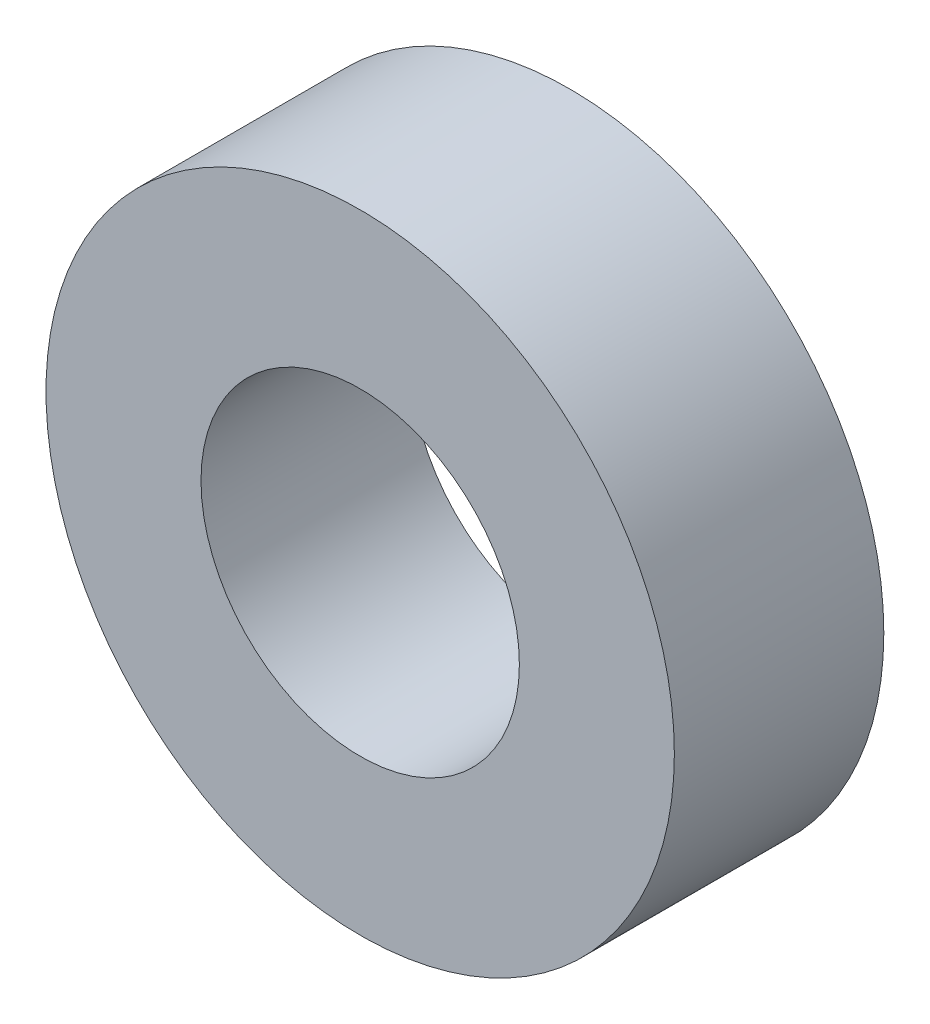
ISO-10303-21;
HEADER;
FILE_DESCRIPTION(('STEP AP214'),'2;1');
FILE_NAME('part.step','',(''),(''),'','','');
FILE_SCHEMA(('AUTOMOTIVE_DESIGN { 1 0 10303 214 1 1 1 1 }'));
ENDSEC;
DATA;
#1=APPLICATION_CONTEXT('core data for automotive mechanical design processes');
#2=APPLICATION_PROTOCOL_DEFINITION('international standard','automotive_design',2000,#1);
#3=PRODUCT_CONTEXT('',#1,'mechanical');
#4=PRODUCT('Part','Part','',(#3));
#5=PRODUCT_RELATED_PRODUCT_CATEGORY('part','',(#4));
#6=PRODUCT_DEFINITION_FORMATION('','',#4);
#7=PRODUCT_DEFINITION_CONTEXT('part definition',#1,'design');
#8=PRODUCT_DEFINITION('design','',#6,#7);
#9=PRODUCT_DEFINITION_SHAPE('','',#8);
#10=(LENGTH_UNIT() NAMED_UNIT(*) SI_UNIT(.MILLI.,.METRE.));
#11=(NAMED_UNIT(*) PLANE_ANGLE_UNIT() SI_UNIT($,.RADIAN.));
#12=(NAMED_UNIT(*) SI_UNIT($,.STERADIAN.) SOLID_ANGLE_UNIT());
#13=UNCERTAINTY_MEASURE_WITH_UNIT(LENGTH_MEASURE(1.E-05),#10,'distance_accuracy_value','');
#14=(GEOMETRIC_REPRESENTATION_CONTEXT(3) GLOBAL_UNCERTAINTY_ASSIGNED_CONTEXT((#13)) GLOBAL_UNIT_ASSIGNED_CONTEXT((#10,
#11,#12)) REPRESENTATION_CONTEXT('',''));
#15=CARTESIAN_POINT('',(0.,0.,0.));
#16=DIRECTION('',(0.,0.,1.));
#17=DIRECTION('',(1.,0.,0.));
#18=AXIS2_PLACEMENT_3D('',#15,#16,#17);
#19=CARTESIAN_POINT('',(0.,0.,3.175));
#20=DIRECTION('',(0.,0.,1.));
#21=DIRECTION('',(1.,0.,0.));
#22=AXIS2_PLACEMENT_3D('',#19,#20,#21);
#23=PLANE('',#22);
#24=CARTESIAN_POINT('',(0.,0.,3.175));
#25=DIRECTION('',(0.,0.,1.));
#26=DIRECTION('',(1.,0.,0.));
#27=AXIS2_PLACEMENT_3D('',#24,#25,#26);
#28=CIRCLE('',#27,9.525);
#29=CARTESIAN_POINT('',(9.525,0.,3.175));
#30=VERTEX_POINT('',#29);
#31=EDGE_CURVE('E10',#30,#30,#28,.T.);
#32=ORIENTED_EDGE('',*,*,#31,.T.);
#33=EDGE_LOOP('',(#32));
#34=FACE_BOUND('',#33,.T.);
#35=CARTESIAN_POINT('',(0.,0.,3.175));
#36=DIRECTION('',(0.,0.,1.));
#37=DIRECTION('',(1.,0.,0.));
#38=AXIS2_PLACEMENT_3D('',#35,#36,#37);
#39=CIRCLE('',#38,4.826);
#40=CARTESIAN_POINT('',(4.826,0.,3.175));
#41=VERTEX_POINT('',#40);
#42=EDGE_CURVE('E43',#41,#41,#39,.T.);
#43=ORIENTED_EDGE('',*,*,#42,.F.);
#44=EDGE_LOOP('',(#43));
#45=FACE_BOUND('',#44,.T.);
#46=ADVANCED_FACE('F32',(#34,#45),#23,.T.);
#47=CARTESIAN_POINT('',(0.,0.,-3.175));
#48=DIRECTION('',(0.,0.,1.));
#49=DIRECTION('',(1.,0.,0.));
#50=AXIS2_PLACEMENT_3D('',#47,#48,#49);
#51=PLANE('',#50);
#52=CARTESIAN_POINT('',(0.,0.,-3.175));
#53=DIRECTION('',(0.,0.,1.));
#54=DIRECTION('',(1.,0.,0.));
#55=AXIS2_PLACEMENT_3D('',#52,#53,#54);
#56=CIRCLE('',#55,9.525);
#57=CARTESIAN_POINT('',(9.525,0.,-3.175));
#58=VERTEX_POINT('',#57);
#59=EDGE_CURVE('E36',#58,#58,#56,.T.);
#60=ORIENTED_EDGE('',*,*,#59,.F.);
#61=EDGE_LOOP('',(#60));
#62=FACE_BOUND('',#61,.T.);
#63=CARTESIAN_POINT('',(0.,0.,-3.175));
#64=DIRECTION('',(0.,0.,1.));
#65=DIRECTION('',(1.,0.,0.));
#66=AXIS2_PLACEMENT_3D('',#63,#64,#65);
#67=CIRCLE('',#66,4.826);
#68=CARTESIAN_POINT('',(4.826,0.,-3.175));
#69=VERTEX_POINT('',#68);
#70=EDGE_CURVE('E45',#69,#69,#67,.T.);
#71=ORIENTED_EDGE('',*,*,#70,.T.);
#72=EDGE_LOOP('',(#71));
#73=FACE_BOUND('',#72,.T.);
#74=ADVANCED_FACE('F55',(#62,#73),#51,.F.);
#75=CARTESIAN_POINT('',(0.,0.,3.175));
#76=DIRECTION('',(0.,0.,-1.));
#77=DIRECTION('',(-1.,0.,0.));
#78=AXIS2_PLACEMENT_3D('',#75,#76,#77);
#79=CYLINDRICAL_SURFACE('',#78,9.525);
#80=ORIENTED_EDGE('',*,*,#31,.F.);
#81=EDGE_LOOP('',(#80));
#82=FACE_BOUND('',#81,.T.);
#83=ORIENTED_EDGE('',*,*,#59,.T.);
#84=EDGE_LOOP('',(#83));
#85=FACE_BOUND('',#84,.T.);
#86=ADVANCED_FACE('F34',(#82,#85),#79,.T.);
#87=CARTESIAN_POINT('',(0.,0.,3.175));
#88=DIRECTION('',(0.,0.,-1.));
#89=DIRECTION('',(-1.,0.,0.));
#90=AXIS2_PLACEMENT_3D('',#87,#88,#89);
#91=CYLINDRICAL_SURFACE('',#90,4.826);
#92=ORIENTED_EDGE('',*,*,#42,.T.);
#93=EDGE_LOOP('',(#92));
#94=FACE_BOUND('',#93,.T.);
#95=ORIENTED_EDGE('',*,*,#70,.F.);
#96=EDGE_LOOP('',(#95));
#97=FACE_BOUND('',#96,.T.);
#98=ADVANCED_FACE('F51',(#94,#97),#91,.F.);
#99=CLOSED_SHELL('',(#46,#74,#86,#98));
#100=MANIFOLD_SOLID_BREP('B2',#99);
#101=ADVANCED_BREP_SHAPE_REPRESENTATION('',(#18,#100),#14);
#102=SHAPE_DEFINITION_REPRESENTATION(#9,#101);
ENDSEC;
END-ISO-10303-21;
